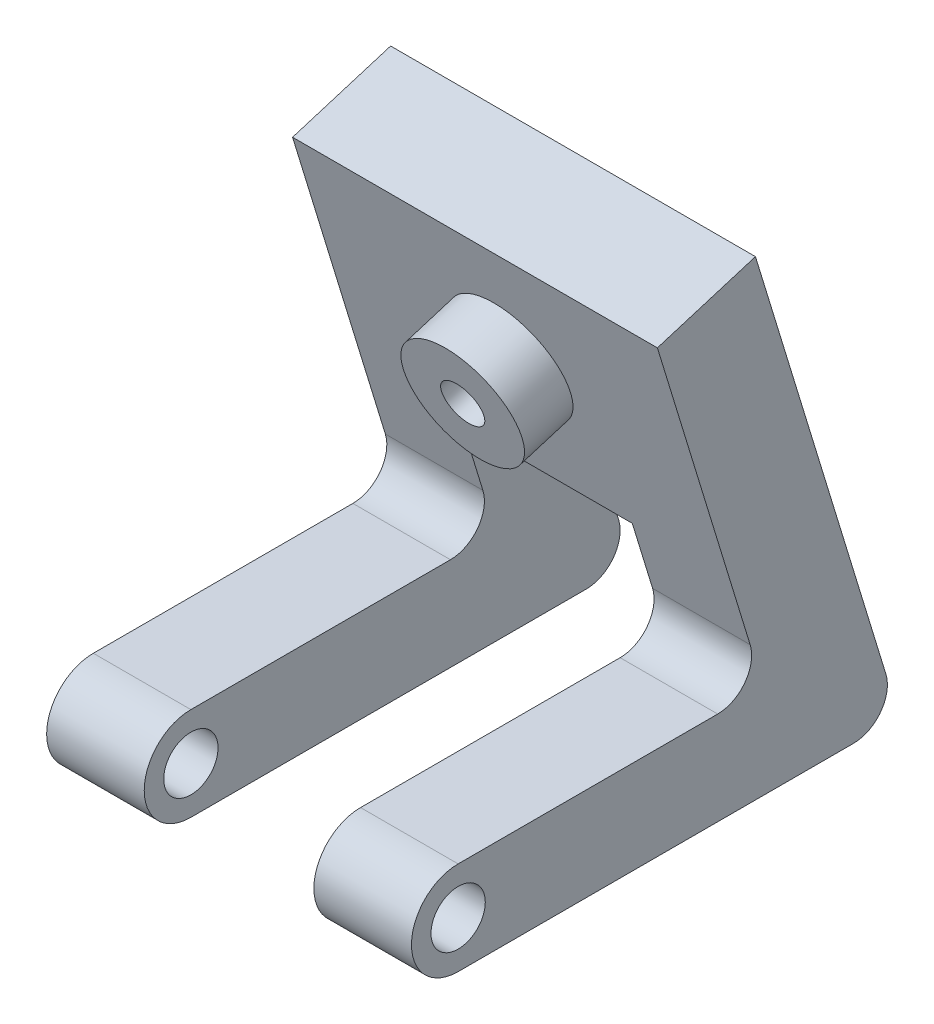
ISO-10303-21;
HEADER;
FILE_DESCRIPTION(('STEP AP214'),'2;1');
FILE_NAME('part.step','',(''),(''),'','','');
FILE_SCHEMA(('AUTOMOTIVE_DESIGN { 1 0 10303 214 1 1 1 1 }'));
ENDSEC;
DATA;
#1=APPLICATION_CONTEXT('core data for automotive mechanical design processes');
#2=APPLICATION_PROTOCOL_DEFINITION('international standard','automotive_design',2000,#1);
#3=PRODUCT_CONTEXT('',#1,'mechanical');
#4=PRODUCT('Part','Part','',(#3));
#5=PRODUCT_RELATED_PRODUCT_CATEGORY('part','',(#4));
#6=PRODUCT_DEFINITION_FORMATION('','',#4);
#7=PRODUCT_DEFINITION_CONTEXT('part definition',#1,'design');
#8=PRODUCT_DEFINITION('design','',#6,#7);
#9=PRODUCT_DEFINITION_SHAPE('','',#8);
#10=(LENGTH_UNIT() NAMED_UNIT(*) SI_UNIT(.MILLI.,.METRE.));
#11=(NAMED_UNIT(*) PLANE_ANGLE_UNIT() SI_UNIT($,.RADIAN.));
#12=(NAMED_UNIT(*) SI_UNIT($,.STERADIAN.) SOLID_ANGLE_UNIT());
#13=UNCERTAINTY_MEASURE_WITH_UNIT(LENGTH_MEASURE(1.E-05),#10,'distance_accuracy_value','');
#14=(GEOMETRIC_REPRESENTATION_CONTEXT(3) GLOBAL_UNCERTAINTY_ASSIGNED_CONTEXT((#13)) GLOBAL_UNIT_ASSIGNED_CONTEXT((#10,
#11,#12)) REPRESENTATION_CONTEXT('',''));
#15=CARTESIAN_POINT('',(0.,0.,0.));
#16=DIRECTION('',(0.,0.,1.));
#17=DIRECTION('',(1.,0.,0.));
#18=AXIS2_PLACEMENT_3D('',#15,#16,#17);
#19=CARTESIAN_POINT('',(27.305,0.,0.));
#20=DIRECTION('',(-1.,0.,0.));
#21=DIRECTION('',(0.,0.,1.));
#22=AXIS2_PLACEMENT_3D('',#19,#20,#21);
#23=CYLINDRICAL_SURFACE('',#22,3.4925);
#24=DIRECTION('',(-1.,0.,0.));
#25=VECTOR('',#24,1.);
#26=CARTESIAN_POINT('',(27.305,-3.4925,0.));
#27=LINE('',#26,#25);
#28=CARTESIAN_POINT('',(7.3025,-3.4925,0.));
#29=VERTEX_POINT('',#28);
#30=CARTESIAN_POINT('',(0.,-3.4925,0.));
#31=VERTEX_POINT('',#30);
#32=EDGE_CURVE('E333',#29,#31,#27,.T.);
#33=ORIENTED_EDGE('',*,*,#32,.F.);
#34=CARTESIAN_POINT('',(7.3025,0.,0.));
#35=DIRECTION('',(-1.,0.,0.));
#36=DIRECTION('',(0.,-1.,0.));
#37=AXIS2_PLACEMENT_3D('',#34,#35,#36);
#38=CIRCLE('',#37,3.4925);
#39=CARTESIAN_POINT('',(7.3025,3.4925,0.));
#40=VERTEX_POINT('',#39);
#41=EDGE_CURVE('E260',#29,#40,#38,.T.);
#42=ORIENTED_EDGE('',*,*,#41,.T.);
#43=DIRECTION('',(-1.,0.,0.));
#44=VECTOR('',#43,1.);
#45=CARTESIAN_POINT('',(27.305,3.4925,0.));
#46=LINE('',#45,#44);
#47=CARTESIAN_POINT('',(0.,3.4925,0.));
#48=VERTEX_POINT('',#47);
#49=EDGE_CURVE('E300',#40,#48,#46,.T.);
#50=ORIENTED_EDGE('',*,*,#49,.T.);
#51=CARTESIAN_POINT('',(0.,0.,0.));
#52=DIRECTION('',(1.,0.,0.));
#53=DIRECTION('',(0.,0.,-1.));
#54=AXIS2_PLACEMENT_3D('',#51,#52,#53);
#55=CIRCLE('',#54,3.4925);
#56=EDGE_CURVE('E275',#48,#31,#55,.T.);
#57=ORIENTED_EDGE('',*,*,#56,.T.);
#58=EDGE_LOOP('',(#33,#42,#50,#57));
#59=FACE_BOUND('',#58,.T.);
#60=ADVANCED_FACE('F43',(#59),#23,.T.);
#61=CARTESIAN_POINT('',(27.305,-3.4925,0.));
#62=DIRECTION('',(0.,1.,0.));
#63=DIRECTION('',(0.,0.,1.));
#64=AXIS2_PLACEMENT_3D('',#61,#62,#63);
#65=PLANE('',#64);
#66=DIRECTION('',(-1.,0.,0.));
#67=VECTOR('',#66,1.);
#68=CARTESIAN_POINT('',(27.305,-3.4925,-29.5873870076177));
#69=LINE('',#68,#67);
#70=CARTESIAN_POINT('',(0.,-3.4925,-29.5873870076177));
#71=VERTEX_POINT('',#70);
#72=CARTESIAN_POINT('',(7.3025,-3.4925,-29.5873870076177));
#73=VERTEX_POINT('',#72);
#74=EDGE_CURVE('E178',#71,#73,#69,.F.);
#75=ORIENTED_EDGE('',*,*,#74,.T.);
#76=DIRECTION('',(0.,0.,1.));
#77=VECTOR('',#76,1.);
#78=CARTESIAN_POINT('',(7.3025,-3.4925,-32.1273870076177));
#79=LINE('',#78,#77);
#80=EDGE_CURVE('E173',#73,#29,#79,.T.);
#81=ORIENTED_EDGE('',*,*,#80,.T.);
#82=ORIENTED_EDGE('',*,*,#32,.T.);
#83=DIRECTION('',(0.,0.,-1.));
#84=VECTOR('',#83,1.);
#85=CARTESIAN_POINT('',(0.,-3.4925,0.));
#86=LINE('',#85,#84);
#87=EDGE_CURVE('E304',#31,#71,#86,.T.);
#88=ORIENTED_EDGE('',*,*,#87,.T.);
#89=EDGE_LOOP('',(#75,#81,#82,#88));
#90=FACE_BOUND('',#89,.T.);
#91=ADVANCED_FACE('F390',(#90),#65,.F.);
#92=CARTESIAN_POINT('',(27.305,3.4925,0.));
#93=DIRECTION('',(0.,-1.,0.));
#94=DIRECTION('',(0.,0.,-1.));
#95=AXIS2_PLACEMENT_3D('',#92,#93,#94);
#96=PLANE('',#95);
#97=ORIENTED_EDGE('',*,*,#49,.F.);
#98=DIRECTION('',(0.,0.,-1.));
#99=VECTOR('',#98,1.);
#100=CARTESIAN_POINT('',(7.3025,3.4925,0.));
#101=LINE('',#100,#99);
#102=CARTESIAN_POINT('',(7.3025,3.4925,-19.4273870076177));
#103=VERTEX_POINT('',#102);
#104=EDGE_CURVE('E254',#40,#103,#101,.T.);
#105=ORIENTED_EDGE('',*,*,#104,.T.);
#106=DIRECTION('',(-1.,0.,0.));
#107=VECTOR('',#106,1.);
#108=CARTESIAN_POINT('',(0.,3.4925,-19.4273870076177));
#109=LINE('',#108,#107);
#110=CARTESIAN_POINT('',(0.,3.4925,-19.4273870076177));
#111=VERTEX_POINT('',#110);
#112=EDGE_CURVE('E336',#103,#111,#109,.T.);
#113=ORIENTED_EDGE('',*,*,#112,.T.);
#114=DIRECTION('',(0.,0.,1.));
#115=VECTOR('',#114,1.);
#116=CARTESIAN_POINT('',(0.,3.4925,0.));
#117=LINE('',#116,#115);
#118=EDGE_CURVE('E284',#111,#48,#117,.T.);
#119=ORIENTED_EDGE('',*,*,#118,.T.);
#120=EDGE_LOOP('',(#97,#105,#113,#119));
#121=FACE_BOUND('',#120,.T.);
#122=ADVANCED_FACE('F397',(#121),#96,.F.);
#123=CARTESIAN_POINT('',(27.305,0.,0.));
#124=DIRECTION('',(-1.,0.,0.));
#125=DIRECTION('',(0.,0.,1.));
#126=AXIS2_PLACEMENT_3D('',#123,#124,#125);
#127=CYLINDRICAL_SURFACE('',#126,2.032);
#128=CARTESIAN_POINT('',(7.3025,0.,0.));
#129=DIRECTION('',(-1.,0.,0.));
#130=DIRECTION('',(0.,-1.,0.));
#131=AXIS2_PLACEMENT_3D('',#128,#129,#130);
#132=CIRCLE('',#131,2.032);
#133=CARTESIAN_POINT('',(7.3025,-2.032,0.));
#134=VERTEX_POINT('',#133);
#135=EDGE_CURVE('E263',#134,#134,#132,.T.);
#136=ORIENTED_EDGE('',*,*,#135,.F.);
#137=EDGE_LOOP('',(#136));
#138=FACE_BOUND('',#137,.T.);
#139=CARTESIAN_POINT('',(0.,0.,0.));
#140=DIRECTION('',(1.,0.,0.));
#141=DIRECTION('',(0.,0.,-1.));
#142=AXIS2_PLACEMENT_3D('',#139,#140,#141);
#143=CIRCLE('',#142,2.032);
#144=CARTESIAN_POINT('',(0.,0.,-2.032));
#145=VERTEX_POINT('',#144);
#146=EDGE_CURVE('E270',#145,#145,#143,.T.);
#147=ORIENTED_EDGE('',*,*,#146,.F.);
#148=EDGE_LOOP('',(#147));
#149=FACE_BOUND('',#148,.T.);
#150=ADVANCED_FACE('F414',(#138,#149),#127,.F.);
#151=CARTESIAN_POINT('',(27.305,6.0325,-19.4273870076177));
#152=DIRECTION('',(1.,0.,0.));
#153=DIRECTION('',(0.,0.,-1.));
#154=AXIS2_PLACEMENT_3D('',#151,#152,#153);
#155=CYLINDRICAL_SURFACE('',#154,2.54);
#156=ORIENTED_EDGE('',*,*,#112,.F.);
#157=CARTESIAN_POINT('',(7.3025,6.0325,-19.4273870076177));
#158=DIRECTION('',(-1.,0.,0.));
#159=DIRECTION('',(0.,-1.,0.));
#160=AXIS2_PLACEMENT_3D('',#157,#158,#159);
#161=CIRCLE('',#160,2.54);
#162=CARTESIAN_POINT('',(7.3025,6.77512412999574,-21.8564010877638));
#163=VERTEX_POINT('',#162);
#164=EDGE_CURVE('E251',#103,#163,#161,.F.);
#165=ORIENTED_EDGE('',*,*,#164,.T.);
#166=DIRECTION('',(-1.,0.,0.));
#167=VECTOR('',#166,1.);
#168=CARTESIAN_POINT('',(27.305,6.77512412999574,-21.8564010877638));
#169=LINE('',#168,#167);
#170=CARTESIAN_POINT('',(0.,6.77512412999574,-21.8564010877638));
#171=VERTEX_POINT('',#170);
#172=EDGE_CURVE('E342',#171,#163,#169,.F.);
#173=ORIENTED_EDGE('',*,*,#172,.F.);
#174=CARTESIAN_POINT('',(0.,6.0325,-19.4273870076177));
#175=DIRECTION('',(1.,0.,0.));
#176=DIRECTION('',(0.,0.,-1.));
#177=AXIS2_PLACEMENT_3D('',#174,#175,#176);
#178=CIRCLE('',#177,2.54);
#179=EDGE_CURVE('E190',#111,#171,#178,.T.);
#180=ORIENTED_EDGE('',*,*,#179,.F.);
#181=EDGE_LOOP('',(#156,#165,#173,#180));
#182=FACE_BOUND('',#181,.T.);
#183=ADVANCED_FACE('F411',(#182),#155,.F.);
#184=CARTESIAN_POINT('',(27.305,-0.9525,-29.5873870076177));
#185=DIRECTION('',(-1.,0.,0.));
#186=DIRECTION('',(0.,0.,1.));
#187=AXIS2_PLACEMENT_3D('',#184,#185,#186);
#188=CYLINDRICAL_SURFACE('',#187,2.54);
#189=CARTESIAN_POINT('',(7.3025,-0.9525,-29.5873870076177));
#190=DIRECTION('',(-1.,0.,0.));
#191=DIRECTION('',(0.,-1.,0.));
#192=AXIS2_PLACEMENT_3D('',#189,#190,#191);
#193=CIRCLE('',#192,2.54);
#194=CARTESIAN_POINT('',(7.3025,-0.209875870004263,-32.0164010877638));
#195=VERTEX_POINT('',#194);
#196=EDGE_CURVE('E165',#73,#195,#193,.F.);
#197=ORIENTED_EDGE('',*,*,#196,.F.);
#198=ORIENTED_EDGE('',*,*,#74,.F.);
#199=CARTESIAN_POINT('',(0.,-0.9525,-29.5873870076177));
#200=DIRECTION('',(1.,0.,0.));
#201=DIRECTION('',(0.,0.,-1.));
#202=AXIS2_PLACEMENT_3D('',#199,#200,#201);
#203=CIRCLE('',#202,2.54);
#204=CARTESIAN_POINT('',(0.,-0.209875870004263,-32.0164010877638));
#205=VERTEX_POINT('',#204);
#206=EDGE_CURVE('E179',#205,#71,#203,.F.);
#207=ORIENTED_EDGE('',*,*,#206,.F.);
#208=DIRECTION('',(-1.,0.,0.));
#209=VECTOR('',#208,1.);
#210=CARTESIAN_POINT('',(27.305,-0.209875870004264,-32.0164010877638));
#211=LINE('',#210,#209);
#212=EDGE_CURVE('E344',#195,#205,#211,.T.);
#213=ORIENTED_EDGE('',*,*,#212,.F.);
#214=EDGE_LOOP('',(#197,#198,#207,#213));
#215=FACE_BOUND('',#214,.T.);
#216=ADVANCED_FACE('F356',(#215),#188,.T.);
#217=CARTESIAN_POINT('',(27.305,0.,0.));
#218=DIRECTION('',(1.,0.,0.));
#219=DIRECTION('',(0.,0.,-1.));
#220=AXIS2_PLACEMENT_3D('',#217,#218,#219);
#221=PLANE('',#220);
#222=DIRECTION('',(0.,0.,-1.));
#223=VECTOR('',#222,1.);
#224=CARTESIAN_POINT('',(27.305,-3.4925,0.));
#225=LINE('',#224,#223);
#226=CARTESIAN_POINT('',(27.305,-3.4925,0.));
#227=VERTEX_POINT('',#226);
#228=CARTESIAN_POINT('',(27.305,-3.4925,-29.5873870076177));
#229=VERTEX_POINT('',#228);
#230=EDGE_CURVE('E283',#227,#229,#225,.T.);
#231=ORIENTED_EDGE('',*,*,#230,.T.);
#232=CARTESIAN_POINT('',(27.305,-0.9525,-29.5873870076177));
#233=DIRECTION('',(1.,0.,0.));
#234=DIRECTION('',(0.,0.,-1.));
#235=AXIS2_PLACEMENT_3D('',#232,#233,#234);
#236=CIRCLE('',#235,2.54);
#237=CARTESIAN_POINT('',(27.305,-0.209875870004263,-32.0164010877638));
#238=VERTEX_POINT('',#237);
#239=EDGE_CURVE('E176',#229,#238,#236,.T.);
#240=ORIENTED_EDGE('',*,*,#239,.T.);
#241=DIRECTION('',(0.,0.956304755963037,0.292371704722731));
#242=VECTOR('',#241,1.);
#243=CARTESIAN_POINT('',(27.305,-3.4925,-33.02));
#244=LINE('',#243,#242);
#245=CARTESIAN_POINT('',(27.305,31.7282041621187,-22.2519501150618));
#246=VERTEX_POINT('',#245);
#247=EDGE_CURVE('E287',#238,#246,#244,.T.);
#248=ORIENTED_EDGE('',*,*,#247,.T.);
#249=DIRECTION('',(0.,-0.292371704722731,0.956304755963037));
#250=VECTOR('',#249,1.);
#251=CARTESIAN_POINT('',(27.305,31.7282041621187,-22.2519501150618));
#252=LINE('',#251,#250);
#253=CARTESIAN_POINT('',(27.305,29.4845904903388,-14.9134204618537));
#254=VERTEX_POINT('',#253);
#255=EDGE_CURVE('E290',#246,#254,#252,.T.);
#256=ORIENTED_EDGE('',*,*,#255,.T.);
#257=DIRECTION('',(0.,-0.956304755963037,-0.292371704722731));
#258=VECTOR('',#257,1.);
#259=CARTESIAN_POINT('',(27.305,3.4925,-22.86));
#260=LINE('',#259,#258);
#261=CARTESIAN_POINT('',(27.305,6.77512412999574,-21.8564010877638));
#262=VERTEX_POINT('',#261);
#263=EDGE_CURVE('E293',#254,#262,#260,.T.);
#264=ORIENTED_EDGE('',*,*,#263,.T.);
#265=CARTESIAN_POINT('',(27.305,6.0325,-19.4273870076177));
#266=DIRECTION('',(1.,0.,0.));
#267=DIRECTION('',(0.,0.,-1.));
#268=AXIS2_PLACEMENT_3D('',#265,#266,#267);
#269=CIRCLE('',#268,2.54);
#270=CARTESIAN_POINT('',(27.305,3.4925,-19.4273870076177));
#271=VERTEX_POINT('',#270);
#272=EDGE_CURVE('E166',#262,#271,#269,.F.);
#273=ORIENTED_EDGE('',*,*,#272,.T.);
#274=DIRECTION('',(0.,0.,1.));
#275=VECTOR('',#274,1.);
#276=CARTESIAN_POINT('',(27.305,3.4925,0.));
#277=LINE('',#276,#275);
#278=CARTESIAN_POINT('',(27.305,3.4925,0.));
#279=VERTEX_POINT('',#278);
#280=EDGE_CURVE('E297',#271,#279,#277,.T.);
#281=ORIENTED_EDGE('',*,*,#280,.T.);
#282=CARTESIAN_POINT('',(27.305,0.,0.));
#283=DIRECTION('',(1.,0.,0.));
#284=DIRECTION('',(0.,0.,-1.));
#285=AXIS2_PLACEMENT_3D('',#282,#283,#284);
#286=CIRCLE('',#285,3.4925);
#287=EDGE_CURVE('E279',#279,#227,#286,.T.);
#288=ORIENTED_EDGE('',*,*,#287,.T.);
#289=EDGE_LOOP('',(#231,#240,#248,#256,#264,#273,#281,#288));
#290=FACE_BOUND('',#289,.T.);
#291=CARTESIAN_POINT('',(27.305,0.,0.));
#292=DIRECTION('',(1.,0.,0.));
#293=DIRECTION('',(0.,0.,-1.));
#294=AXIS2_PLACEMENT_3D('',#291,#292,#293);
#295=CIRCLE('',#294,2.032);
#296=CARTESIAN_POINT('',(27.305,0.,-2.032));
#297=VERTEX_POINT('',#296);
#298=EDGE_CURVE('E271',#297,#297,#295,.T.);
#299=ORIENTED_EDGE('',*,*,#298,.F.);
#300=EDGE_LOOP('',(#299));
#301=FACE_BOUND('',#300,.T.);
#302=ADVANCED_FACE('F371',(#290,#301),#221,.T.);
#303=CARTESIAN_POINT('',(0.,0.,0.));
#304=DIRECTION('',(1.,0.,0.));
#305=DIRECTION('',(0.,0.,-1.));
#306=AXIS2_PLACEMENT_3D('',#303,#304,#305);
#307=PLANE('',#306);
#308=DIRECTION('',(0.,0.956304755963037,0.292371704722731));
#309=VECTOR('',#308,1.);
#310=CARTESIAN_POINT('',(0.,-3.4925,-33.02));
#311=LINE('',#310,#309);
#312=CARTESIAN_POINT('',(0.,31.7282041621187,-22.2519501150618));
#313=VERTEX_POINT('',#312);
#314=EDGE_CURVE('E308',#205,#313,#311,.T.);
#315=ORIENTED_EDGE('',*,*,#314,.F.);
#316=ORIENTED_EDGE('',*,*,#206,.T.);
#317=ORIENTED_EDGE('',*,*,#87,.F.);
#318=ORIENTED_EDGE('',*,*,#56,.F.);
#319=ORIENTED_EDGE('',*,*,#118,.F.);
#320=ORIENTED_EDGE('',*,*,#179,.T.);
#321=DIRECTION('',(0.,-0.956304755963037,-0.292371704722731));
#322=VECTOR('',#321,1.);
#323=CARTESIAN_POINT('',(0.,3.4925,-22.86));
#324=LINE('',#323,#322);
#325=CARTESIAN_POINT('',(0.,29.4845904903388,-14.9134204618537));
#326=VERTEX_POINT('',#325);
#327=EDGE_CURVE('E314',#326,#171,#324,.T.);
#328=ORIENTED_EDGE('',*,*,#327,.F.);
#329=DIRECTION('',(0.,-0.292371704722731,0.956304755963037));
#330=VECTOR('',#329,1.);
#331=CARTESIAN_POINT('',(0.,31.7282041621187,-22.2519501150618));
#332=LINE('',#331,#330);
#333=EDGE_CURVE('E311',#313,#326,#332,.T.);
#334=ORIENTED_EDGE('',*,*,#333,.F.);
#335=EDGE_LOOP('',(#315,#316,#317,#318,#319,#320,#328,#334));
#336=FACE_BOUND('',#335,.T.);
#337=ORIENTED_EDGE('',*,*,#146,.T.);
#338=EDGE_LOOP('',(#337));
#339=FACE_BOUND('',#338,.T.);
#340=ADVANCED_FACE('F360',(#336,#339),#307,.F.);
#341=CARTESIAN_POINT('',(20.0025,0.,0.));
#342=DIRECTION('',(1.,0.,0.));
#343=DIRECTION('',(0.,1.,0.));
#344=AXIS2_PLACEMENT_3D('',#341,#342,#343);
#345=CIRCLE('',#344,3.4925);
#346=CARTESIAN_POINT('',(20.0025,3.4925,0.));
#347=VERTEX_POINT('',#346);
#348=CARTESIAN_POINT('',(20.0025,-3.4925,0.));
#349=VERTEX_POINT('',#348);
#350=EDGE_CURVE('E242',#347,#349,#345,.T.);
#351=ORIENTED_EDGE('',*,*,#350,.T.);
#352=EDGE_CURVE('E170',#227,#349,#27,.T.);
#353=ORIENTED_EDGE('',*,*,#352,.F.);
#354=ORIENTED_EDGE('',*,*,#287,.F.);
#355=EDGE_CURVE('E321',#279,#347,#46,.T.);
#356=ORIENTED_EDGE('',*,*,#355,.T.);
#357=EDGE_LOOP('',(#351,#353,#354,#356));
#358=FACE_BOUND('',#357,.T.);
#359=ADVANCED_FACE('F382',(#358),#23,.T.);
#360=ORIENTED_EDGE('',*,*,#352,.T.);
#361=DIRECTION('',(0.,0.,1.));
#362=VECTOR('',#361,1.);
#363=CARTESIAN_POINT('',(20.0025,-3.4925,-32.1273870076177));
#364=LINE('',#363,#362);
#365=CARTESIAN_POINT('',(20.0025,-3.4925,-29.5873870076177));
#366=VERTEX_POINT('',#365);
#367=EDGE_CURVE('E159',#366,#349,#364,.T.);
#368=ORIENTED_EDGE('',*,*,#367,.F.);
#369=EDGE_CURVE('E67',#366,#229,#69,.F.);
#370=ORIENTED_EDGE('',*,*,#369,.T.);
#371=ORIENTED_EDGE('',*,*,#230,.F.);
#372=EDGE_LOOP('',(#360,#368,#370,#371));
#373=FACE_BOUND('',#372,.T.);
#374=ADVANCED_FACE('F168',(#373),#65,.F.);
#375=CARTESIAN_POINT('',(27.305,-3.4925,-33.02));
#376=DIRECTION('',(0.,-0.292371704722731,0.956304755963037));
#377=DIRECTION('',(0.,-0.956304755963037,-0.292371704722731));
#378=AXIS2_PLACEMENT_3D('',#375,#376,#377);
#379=PLANE('',#378);
#380=DIRECTION('',(-1.,0.,0.));
#381=VECTOR('',#380,1.);
#382=CARTESIAN_POINT('',(27.305,11.7475,-28.3606644145701));
#383=LINE('',#382,#381);
#384=CARTESIAN_POINT('',(20.0025,11.7475,-28.3606644145701));
#385=VERTEX_POINT('',#384);
#386=CARTESIAN_POINT('',(7.3025,11.7475,-28.3606644145701));
#387=VERTEX_POINT('',#386);
#388=EDGE_CURVE('E267',#385,#387,#383,.T.);
#389=ORIENTED_EDGE('',*,*,#388,.T.);
#390=DIRECTION('',(0.,-0.956304755963037,-0.292371704722731));
#391=VECTOR('',#390,1.);
#392=CARTESIAN_POINT('',(7.3025,-3.4925,-33.02));
#393=LINE('',#392,#391);
#394=EDGE_CURVE('E218',#387,#195,#393,.T.);
#395=ORIENTED_EDGE('',*,*,#394,.T.);
#396=ORIENTED_EDGE('',*,*,#212,.T.);
#397=ORIENTED_EDGE('',*,*,#314,.T.);
#398=DIRECTION('',(-1.,0.,0.));
#399=VECTOR('',#398,1.);
#400=CARTESIAN_POINT('',(27.305,31.7282041621187,-22.2519501150618));
#401=LINE('',#400,#399);
#402=EDGE_CURVE('E329',#246,#313,#401,.T.);
#403=ORIENTED_EDGE('',*,*,#402,.F.);
#404=ORIENTED_EDGE('',*,*,#247,.F.);
#405=CARTESIAN_POINT('',(20.0025,-0.209875870004264,-32.0164010877638));
#406=VERTEX_POINT('',#405);
#407=EDGE_CURVE('E184',#238,#406,#211,.T.);
#408=ORIENTED_EDGE('',*,*,#407,.T.);
#409=DIRECTION('',(0.,0.956304755963037,0.292371704722731));
#410=VECTOR('',#409,1.);
#411=CARTESIAN_POINT('',(20.0025,-3.4925,-33.02));
#412=LINE('',#411,#410);
#413=EDGE_CURVE('E59',#406,#385,#412,.T.);
#414=ORIENTED_EDGE('',*,*,#413,.T.);
#415=EDGE_LOOP('',(#389,#395,#396,#397,#403,#404,#408,#414));
#416=FACE_BOUND('',#415,.T.);
#417=ADVANCED_FACE('F351',(#416),#379,.F.);
#418=CARTESIAN_POINT('',(27.305,31.7282041621187,-22.2519501150618));
#419=DIRECTION('',(0.,-0.956304755963037,-0.292371704722731));
#420=DIRECTION('',(0.,0.292371704722731,-0.956304755963037));
#421=AXIS2_PLACEMENT_3D('',#418,#419,#420);
#422=PLANE('',#421);
#423=ORIENTED_EDGE('',*,*,#333,.T.);
#424=DIRECTION('',(-1.,0.,0.));
#425=VECTOR('',#424,1.);
#426=CARTESIAN_POINT('',(27.305,29.4845904903388,-14.9134204618537));
#427=LINE('',#426,#425);
#428=EDGE_CURVE('E325',#254,#326,#427,.T.);
#429=ORIENTED_EDGE('',*,*,#428,.F.);
#430=ORIENTED_EDGE('',*,*,#255,.F.);
#431=ORIENTED_EDGE('',*,*,#402,.T.);
#432=EDGE_LOOP('',(#423,#429,#430,#431));
#433=FACE_BOUND('',#432,.T.);
#434=ADVANCED_FACE('F365',(#433),#422,.F.);
#435=CARTESIAN_POINT('',(27.305,3.4925,-22.86));
#436=DIRECTION('',(0.,0.292371704722731,-0.956304755963037));
#437=DIRECTION('',(0.,0.956304755963037,0.292371704722731));
#438=AXIS2_PLACEMENT_3D('',#435,#436,#437);
#439=PLANE('',#438);
#440=CARTESIAN_POINT('',(13.6525,20.6160452451694,-17.6248068432063));
#441=DIRECTION('',(0.,0.292371704722731,-0.956304755963037));
#442=DIRECTION('',(0.,0.956304755963037,0.292371704722731));
#443=AXIS2_PLACEMENT_3D('',#440,#441,#442);
#444=CIRCLE('',#443,4.445);
#445=CARTESIAN_POINT('',(13.6525,24.8668198854251,-16.3252146157137));
#446=VERTEX_POINT('',#445);
#447=EDGE_CURVE('E11',#446,#446,#444,.F.);
#448=ORIENTED_EDGE('',*,*,#447,.F.);
#449=EDGE_LOOP('',(#448));
#450=FACE_BOUND('',#449,.T.);
#451=ORIENTED_EDGE('',*,*,#172,.T.);
#452=DIRECTION('',(0.,0.956304755963037,0.292371704722731));
#453=VECTOR('',#452,1.);
#454=CARTESIAN_POINT('',(7.3025,3.4925,-22.86));
#455=LINE('',#454,#453);
#456=CARTESIAN_POINT('',(7.3025,11.7475,-20.3361932245588));
#457=VERTEX_POINT('',#456);
#458=EDGE_CURVE('E205',#163,#457,#455,.T.);
#459=ORIENTED_EDGE('',*,*,#458,.T.);
#460=DIRECTION('',(1.,0.,0.));
#461=VECTOR('',#460,1.);
#462=CARTESIAN_POINT('',(27.305,11.7475,-20.3361932245588));
#463=LINE('',#462,#461);
#464=CARTESIAN_POINT('',(20.0025,11.7475,-20.3361932245588));
#465=VERTEX_POINT('',#464);
#466=EDGE_CURVE('E52',#457,#465,#463,.T.);
#467=ORIENTED_EDGE('',*,*,#466,.T.);
#468=DIRECTION('',(0.,-0.956304755963037,-0.292371704722731));
#469=VECTOR('',#468,1.);
#470=CARTESIAN_POINT('',(20.0025,3.4925,-22.86));
#471=LINE('',#470,#469);
#472=CARTESIAN_POINT('',(20.0025,6.77512412999574,-21.8564010877638));
#473=VERTEX_POINT('',#472);
#474=EDGE_CURVE('E203',#465,#473,#471,.T.);
#475=ORIENTED_EDGE('',*,*,#474,.T.);
#476=EDGE_CURVE('E341',#473,#262,#169,.F.);
#477=ORIENTED_EDGE('',*,*,#476,.T.);
#478=ORIENTED_EDGE('',*,*,#263,.F.);
#479=ORIENTED_EDGE('',*,*,#428,.T.);
#480=ORIENTED_EDGE('',*,*,#327,.T.);
#481=EDGE_LOOP('',(#451,#459,#467,#475,#477,#478,#479,#480));
#482=FACE_BOUND('',#481,.T.);
#483=ADVANCED_FACE('F202',(#450,#482),#439,.F.);
#484=CARTESIAN_POINT('',(20.0025,3.4925,-19.4273870076177));
#485=VERTEX_POINT('',#484);
#486=EDGE_CURVE('E337',#271,#485,#109,.T.);
#487=ORIENTED_EDGE('',*,*,#486,.T.);
#488=DIRECTION('',(0.,0.,1.));
#489=VECTOR('',#488,1.);
#490=CARTESIAN_POINT('',(20.0025,3.4925,0.));
#491=LINE('',#490,#489);
#492=EDGE_CURVE('E236',#485,#347,#491,.T.);
#493=ORIENTED_EDGE('',*,*,#492,.T.);
#494=ORIENTED_EDGE('',*,*,#355,.F.);
#495=ORIENTED_EDGE('',*,*,#280,.F.);
#496=EDGE_LOOP('',(#487,#493,#494,#495));
#497=FACE_BOUND('',#496,.T.);
#498=ADVANCED_FACE('F378',(#497),#96,.F.);
#499=CARTESIAN_POINT('',(20.0025,0.,0.));
#500=DIRECTION('',(1.,0.,0.));
#501=DIRECTION('',(0.,1.,0.));
#502=AXIS2_PLACEMENT_3D('',#499,#500,#501);
#503=CIRCLE('',#502,2.032);
#504=CARTESIAN_POINT('',(20.0025,2.032,0.));
#505=VERTEX_POINT('',#504);
#506=EDGE_CURVE('E245',#505,#505,#503,.T.);
#507=ORIENTED_EDGE('',*,*,#506,.F.);
#508=EDGE_LOOP('',(#507));
#509=FACE_BOUND('',#508,.T.);
#510=ORIENTED_EDGE('',*,*,#298,.T.);
#511=EDGE_LOOP('',(#510));
#512=FACE_BOUND('',#511,.T.);
#513=ADVANCED_FACE('F421',(#509,#512),#127,.F.);
#514=ORIENTED_EDGE('',*,*,#476,.F.);
#515=CARTESIAN_POINT('',(20.0025,6.0325,-19.4273870076177));
#516=DIRECTION('',(1.,0.,0.));
#517=DIRECTION('',(0.,1.,0.));
#518=AXIS2_PLACEMENT_3D('',#515,#516,#517);
#519=CIRCLE('',#518,2.54);
#520=EDGE_CURVE('E223',#473,#485,#519,.F.);
#521=ORIENTED_EDGE('',*,*,#520,.T.);
#522=ORIENTED_EDGE('',*,*,#486,.F.);
#523=ORIENTED_EDGE('',*,*,#272,.F.);
#524=EDGE_LOOP('',(#514,#521,#522,#523));
#525=FACE_BOUND('',#524,.T.);
#526=ADVANCED_FACE('F376',(#525),#155,.F.);
#527=ORIENTED_EDGE('',*,*,#369,.F.);
#528=CARTESIAN_POINT('',(20.0025,-0.9525,-29.5873870076177));
#529=DIRECTION('',(1.,0.,0.));
#530=DIRECTION('',(0.,1.,0.));
#531=AXIS2_PLACEMENT_3D('',#528,#529,#530);
#532=CIRCLE('',#531,2.54);
#533=EDGE_CURVE('E157',#406,#366,#532,.F.);
#534=ORIENTED_EDGE('',*,*,#533,.F.);
#535=ORIENTED_EDGE('',*,*,#407,.F.);
#536=ORIENTED_EDGE('',*,*,#239,.F.);
#537=EDGE_LOOP('',(#527,#534,#535,#536));
#538=FACE_BOUND('',#537,.T.);
#539=ADVANCED_FACE('F45',(#538),#188,.T.);
#540=CARTESIAN_POINT('',(7.3025,11.7475,-32.1273870076177));
#541=DIRECTION('',(0.,1.,0.));
#542=DIRECTION('',(-1.,0.,0.));
#543=AXIS2_PLACEMENT_3D('',#540,#541,#542);
#544=PLANE('',#543);
#545=DIRECTION('',(0.,0.,1.));
#546=VECTOR('',#545,1.);
#547=CARTESIAN_POINT('',(20.0025,11.7475,-32.1273870076177));
#548=LINE('',#547,#546);
#549=EDGE_CURVE('E172',#385,#465,#548,.T.);
#550=ORIENTED_EDGE('',*,*,#549,.T.);
#551=ORIENTED_EDGE('',*,*,#466,.F.);
#552=DIRECTION('',(0.,0.,1.));
#553=VECTOR('',#552,1.);
#554=CARTESIAN_POINT('',(7.3025,11.7475,-32.1273870076177));
#555=LINE('',#554,#553);
#556=EDGE_CURVE('E211',#387,#457,#555,.T.);
#557=ORIENTED_EDGE('',*,*,#556,.F.);
#558=ORIENTED_EDGE('',*,*,#388,.F.);
#559=EDGE_LOOP('',(#550,#551,#557,#558));
#560=FACE_BOUND('',#559,.T.);
#561=ADVANCED_FACE('F210',(#560),#544,.F.);
#562=CARTESIAN_POINT('',(7.3025,11.7475,-32.1273870076177));
#563=DIRECTION('',(-1.,0.,0.));
#564=DIRECTION('',(0.,-1.,0.));
#565=AXIS2_PLACEMENT_3D('',#562,#563,#564);
#566=PLANE('',#565);
#567=ORIENTED_EDGE('',*,*,#135,.T.);
#568=EDGE_LOOP('',(#567));
#569=FACE_BOUND('',#568,.T.);
#570=ORIENTED_EDGE('',*,*,#80,.F.);
#571=ORIENTED_EDGE('',*,*,#196,.T.);
#572=ORIENTED_EDGE('',*,*,#394,.F.);
#573=ORIENTED_EDGE('',*,*,#556,.T.);
#574=ORIENTED_EDGE('',*,*,#458,.F.);
#575=ORIENTED_EDGE('',*,*,#164,.F.);
#576=ORIENTED_EDGE('',*,*,#104,.F.);
#577=ORIENTED_EDGE('',*,*,#41,.F.);
#578=EDGE_LOOP('',(#570,#571,#572,#573,#574,#575,#576,#577));
#579=FACE_BOUND('',#578,.T.);
#580=ADVANCED_FACE('F215',(#569,#579),#566,.F.);
#581=CARTESIAN_POINT('',(20.0025,11.7475,-32.1273870076177));
#582=DIRECTION('',(1.,0.,0.));
#583=DIRECTION('',(0.,1.,0.));
#584=AXIS2_PLACEMENT_3D('',#581,#582,#583);
#585=PLANE('',#584);
#586=ORIENTED_EDGE('',*,*,#506,.T.);
#587=EDGE_LOOP('',(#586));
#588=FACE_BOUND('',#587,.T.);
#589=ORIENTED_EDGE('',*,*,#350,.F.);
#590=ORIENTED_EDGE('',*,*,#492,.F.);
#591=ORIENTED_EDGE('',*,*,#520,.F.);
#592=ORIENTED_EDGE('',*,*,#474,.F.);
#593=ORIENTED_EDGE('',*,*,#549,.F.);
#594=ORIENTED_EDGE('',*,*,#413,.F.);
#595=ORIENTED_EDGE('',*,*,#533,.T.);
#596=ORIENTED_EDGE('',*,*,#367,.T.);
#597=EDGE_LOOP('',(#589,#590,#591,#592,#593,#594,#595,#596));
#598=FACE_BOUND('',#597,.T.);
#599=ADVANCED_FACE('F158',(#588,#598),#585,.F.);
#600=CARTESIAN_POINT('',(13.6525,19.506055099991,-13.9941926703577));
#601=DIRECTION('',(0.,-0.292371704722731,0.956304755963037));
#602=DIRECTION('',(0.,-0.956304755963037,-0.292371704722731));
#603=AXIS2_PLACEMENT_3D('',#600,#601,#602);
#604=PLANE('',#603);
#605=CARTESIAN_POINT('',(13.6525,19.506055099991,-13.9941926703577));
#606=DIRECTION('',(0.,-0.292371704722731,0.956304755963037));
#607=DIRECTION('',(0.,-0.956304755963037,-0.292371704722731));
#608=AXIS2_PLACEMENT_3D('',#605,#606,#607);
#609=CIRCLE('',#608,4.445);
#610=CARTESIAN_POINT('',(13.6525,15.2552804597353,-15.2937848978503));
#611=VERTEX_POINT('',#610);
#612=EDGE_CURVE('E227',#611,#611,#609,.T.);
#613=ORIENTED_EDGE('',*,*,#612,.T.);
#614=EDGE_LOOP('',(#613));
#615=FACE_BOUND('',#614,.T.);
#616=CARTESIAN_POINT('',(13.6525,19.506055099991,-13.9941926703577));
#617=DIRECTION('',(0.,-0.292371704722731,0.956304755963037));
#618=DIRECTION('',(0.,-0.956304755963037,-0.292371704722731));
#619=AXIS2_PLACEMENT_3D('',#616,#617,#618);
#620=CIRCLE('',#619,1.5875);
#621=CARTESIAN_POINT('',(13.6525,17.9879212998997,-14.4583327516051));
#622=VERTEX_POINT('',#621);
#623=EDGE_CURVE('E654',#622,#622,#620,.T.);
#624=ORIENTED_EDGE('',*,*,#623,.F.);
#625=EDGE_LOOP('',(#624));
#626=FACE_BOUND('',#625,.T.);
#627=ADVANCED_FACE('F510',(#615,#626),#604,.T.);
#628=CARTESIAN_POINT('',(13.6525,19.506055099991,-13.9941926703577));
#629=DIRECTION('',(0.,0.292371704722731,-0.956304755963037));
#630=DIRECTION('',(0.,0.956304755963037,0.292371704722731));
#631=AXIS2_PLACEMENT_3D('',#628,#629,#630);
#632=CYLINDRICAL_SURFACE('',#631,4.445);
#633=ORIENTED_EDGE('',*,*,#612,.F.);
#634=EDGE_LOOP('',(#633));
#635=FACE_BOUND('',#634,.T.);
#636=ORIENTED_EDGE('',*,*,#447,.T.);
#637=EDGE_LOOP('',(#636));
#638=FACE_BOUND('',#637,.T.);
#639=ADVANCED_FACE('F520',(#635,#638),#632,.T.);
#640=CARTESIAN_POINT('',(13.6525,19.506055099991,-13.9941926703577));
#641=DIRECTION('',(0.,0.292371704722731,-0.956304755963037));
#642=DIRECTION('',(0.,0.956304755963037,0.292371704722731));
#643=AXIS2_PLACEMENT_3D('',#640,#641,#642);
#644=CYLINDRICAL_SURFACE('',#643,1.5875);
#645=ORIENTED_EDGE('',*,*,#623,.T.);
#646=EDGE_LOOP('',(#645));
#647=FACE_BOUND('',#646,.T.);
#648=CARTESIAN_POINT('',(13.6525,20.6160452451694,-17.6248068432063));
#649=DIRECTION('',(0.,-0.292371704722731,0.956304755963037));
#650=DIRECTION('',(0.,-0.956304755963037,-0.292371704722731));
#651=AXIS2_PLACEMENT_3D('',#648,#649,#650);
#652=CIRCLE('',#651,1.5875);
#653=CARTESIAN_POINT('',(13.6525,19.0979114450781,-18.0889469244536));
#654=VERTEX_POINT('',#653);
#655=EDGE_CURVE('E651',#654,#654,#652,.T.);
#656=ORIENTED_EDGE('',*,*,#655,.F.);
#657=EDGE_LOOP('',(#656));
#658=FACE_BOUND('',#657,.T.);
#659=ADVANCED_FACE('F528',(#647,#658),#644,.F.);
#660=ORIENTED_EDGE('',*,*,#655,.T.);
#661=EDGE_LOOP('',(#660));
#662=FACE_BOUND('',#661,.T.);
#663=ADVANCED_FACE('F442',(#662),#439,.F.);
#664=CLOSED_SHELL('',(#60,#91,#122,#150,#183,#216,#302,#340,#359,#374,#417,#434,#483,#498,#513,
#526,#539,#561,#580,#599,#627,#639,#659,#663));
#665=MANIFOLD_SOLID_BREP('B2',#664);
#666=ADVANCED_BREP_SHAPE_REPRESENTATION('',(#18,#665),#14);
#667=SHAPE_DEFINITION_REPRESENTATION(#9,#666);
ENDSEC;
END-ISO-10303-21;
